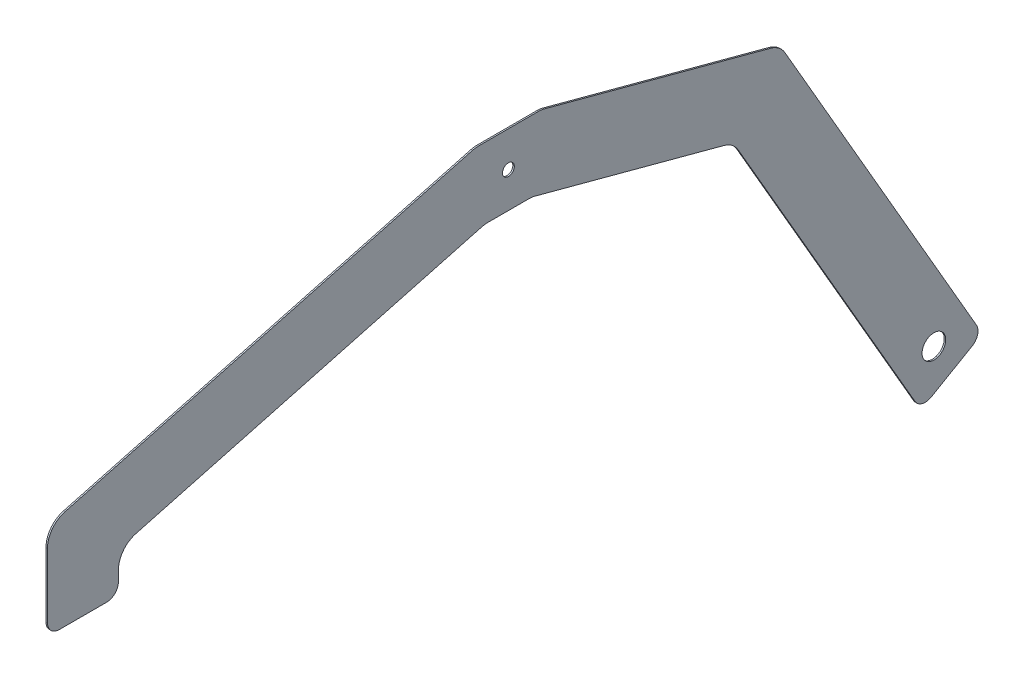
ISO-10303-21;
HEADER;
FILE_DESCRIPTION(('STEP AP214'),'2;1');
FILE_NAME('part.step','',(''),(''),'','','');
FILE_SCHEMA(('AUTOMOTIVE_DESIGN { 1 0 10303 214 1 1 1 1 }'));
ENDSEC;
DATA;
#1=APPLICATION_CONTEXT('core data for automotive mechanical design processes');
#2=APPLICATION_PROTOCOL_DEFINITION('international standard','automotive_design',2000,#1);
#3=PRODUCT_CONTEXT('',#1,'mechanical');
#4=PRODUCT('Part','Part','',(#3));
#5=PRODUCT_RELATED_PRODUCT_CATEGORY('part','',(#4));
#6=PRODUCT_DEFINITION_FORMATION('','',#4);
#7=PRODUCT_DEFINITION_CONTEXT('part definition',#1,'design');
#8=PRODUCT_DEFINITION('design','',#6,#7);
#9=PRODUCT_DEFINITION_SHAPE('','',#8);
#10=(LENGTH_UNIT() NAMED_UNIT(*) SI_UNIT(.MILLI.,.METRE.));
#11=(NAMED_UNIT(*) PLANE_ANGLE_UNIT() SI_UNIT($,.RADIAN.));
#12=(NAMED_UNIT(*) SI_UNIT($,.STERADIAN.) SOLID_ANGLE_UNIT());
#13=UNCERTAINTY_MEASURE_WITH_UNIT(LENGTH_MEASURE(1.E-05),#10,'distance_accuracy_value','');
#14=(GEOMETRIC_REPRESENTATION_CONTEXT(3) GLOBAL_UNCERTAINTY_ASSIGNED_CONTEXT((#13)) GLOBAL_UNIT_ASSIGNED_CONTEXT((#10,
#11,#12)) REPRESENTATION_CONTEXT('',''));
#15=CARTESIAN_POINT('',(0.,0.,0.));
#16=DIRECTION('',(0.,0.,1.));
#17=DIRECTION('',(1.,0.,0.));
#18=AXIS2_PLACEMENT_3D('',#15,#16,#17);
#19=CARTESIAN_POINT('',(1.5875,0.,0.));
#20=DIRECTION('',(-1.,0.,0.));
#21=DIRECTION('',(0.,0.,1.));
#22=AXIS2_PLACEMENT_3D('',#19,#20,#21);
#23=PLANE('',#22);
#24=DIRECTION('',(0.,0.499999999999998,-0.866025403784439));
#25=VECTOR('',#24,1.);
#26=CARTESIAN_POINT('',(1.5875,-445.14184846032,-443.254432115813));
#27=LINE('',#26,#25);
#28=CARTESIAN_POINT('',(1.5875,-438.79184846032,-454.252954743875));
#29=VERTEX_POINT('',#28);
#30=CARTESIAN_POINT('',(1.5875,-413.39184846032,-498.247045256125));
#31=VERTEX_POINT('',#30);
#32=EDGE_CURVE('E399',#29,#31,#27,.T.);
#33=ORIENTED_EDGE('',*,*,#32,.T.);
#34=CARTESIAN_POINT('',(1.5875,-402.393325832258,-491.897045256125));
#35=DIRECTION('',(-1.,0.,0.));
#36=DIRECTION('',(0.,0.,1.));
#37=AXIS2_PLACEMENT_3D('',#34,#35,#36);
#38=CIRCLE('',#37,12.7);
#39=CARTESIAN_POINT('',(1.5875,-396.043325832258,-502.895567884187));
#40=VERTEX_POINT('',#39);
#41=EDGE_CURVE('E323',#31,#40,#38,.F.);
#42=ORIENTED_EDGE('',*,*,#41,.T.);
#43=DIRECTION('',(0.,0.86602540378444,0.499999999999998));
#44=VECTOR('',#43,1.);
#45=CARTESIAN_POINT('',(1.5875,-407.04184846032,-509.245567884187));
#46=LINE('',#45,#44);
#47=CARTESIAN_POINT('',(1.5875,-39.7377700143835,-297.18245931898));
#48=VERTEX_POINT('',#47);
#49=EDGE_CURVE('E397',#40,#48,#46,.T.);
#50=ORIENTED_EDGE('',*,*,#49,.T.);
#51=CARTESIAN_POINT('',(1.5875,-52.4377700143834,-275.185414062855));
#52=DIRECTION('',(-1.,0.,0.));
#53=DIRECTION('',(0.,0.,1.));
#54=AXIS2_PLACEMENT_3D('',#51,#52,#53);
#55=CIRCLE('',#54,25.4);
#56=CARTESIAN_POINT('',(1.5875,-27.9032540266411,-281.759417808459));
#57=VERTEX_POINT('',#56);
#58=EDGE_CURVE('E289',#48,#57,#55,.F.);
#59=ORIENTED_EDGE('',*,*,#58,.T.);
#60=DIRECTION('',(0.,0.258819045102521,0.965925826289068));
#61=VECTOR('',#60,1.);
#62=CARTESIAN_POINT('',(1.5875,38.1,-35.4319203161596));
#63=LINE('',#62,#61);
#64=CARTESIAN_POINT('',(1.5875,37.2345159877423,-38.6619506230438));
#65=VERTEX_POINT('',#64);
#66=EDGE_CURVE('E392',#57,#65,#63,.T.);
#67=ORIENTED_EDGE('',*,*,#66,.T.);
#68=CARTESIAN_POINT('',(1.5875,12.7,-32.0879468774398));
#69=DIRECTION('',(-1.,0.,0.));
#70=DIRECTION('',(0.,0.,1.));
#71=AXIS2_PLACEMENT_3D('',#68,#69,#70);
#72=CIRCLE('',#71,25.4);
#73=CARTESIAN_POINT('',(1.5875,38.1,-32.0879468774398));
#74=VERTEX_POINT('',#73);
#75=EDGE_CURVE('E291',#65,#74,#72,.F.);
#76=ORIENTED_EDGE('',*,*,#75,.T.);
#77=DIRECTION('',(0.,0.,1.));
#78=VECTOR('',#77,1.);
#79=CARTESIAN_POINT('',(1.5875,38.1,35.4319203161593));
#80=LINE('',#79,#78);
#81=CARTESIAN_POINT('',(1.5875,38.1,32.0879468774396));
#82=VERTEX_POINT('',#81);
#83=EDGE_CURVE('E388',#74,#82,#80,.T.);
#84=ORIENTED_EDGE('',*,*,#83,.T.);
#85=CARTESIAN_POINT('',(1.5875,12.7,32.0879468774396));
#86=DIRECTION('',(-1.,0.,0.));
#87=DIRECTION('',(0.,0.,1.));
#88=AXIS2_PLACEMENT_3D('',#85,#86,#87);
#89=CIRCLE('',#88,25.4);
#90=CARTESIAN_POINT('',(1.5875,37.2345159877424,38.6619506230434));
#91=VERTEX_POINT('',#90);
#92=EDGE_CURVE('E293',#82,#91,#89,.F.);
#93=ORIENTED_EDGE('',*,*,#92,.T.);
#94=DIRECTION('',(0.,-0.258819045102514,0.96592582628907));
#95=VECTOR('',#94,1.);
#96=CARTESIAN_POINT('',(1.5875,38.1,35.4319203161593));
#97=LINE('',#96,#95);
#98=CARTESIAN_POINT('',(1.5875,-80.0768700830564,476.474003745604));
#99=VERTEX_POINT('',#98);
#100=EDGE_CURVE('E387',#91,#99,#97,.T.);
#101=ORIENTED_EDGE('',*,*,#100,.T.);
#102=CARTESIAN_POINT('',(1.5875,-104.611386070799,469.9));
#103=DIRECTION('',(-1.,0.,0.));
#104=DIRECTION('',(0.,0.,1.));
#105=AXIS2_PLACEMENT_3D('',#102,#103,#104);
#106=CIRCLE('',#105,25.4);
#107=CARTESIAN_POINT('',(1.5875,-104.611386070799,495.3));
#108=VERTEX_POINT('',#107);
#109=EDGE_CURVE('E234',#99,#108,#106,.F.);
#110=ORIENTED_EDGE('',*,*,#109,.T.);
#111=DIRECTION('',(0.,-1.,0.));
#112=VECTOR('',#111,1.);
#113=CARTESIAN_POINT('',(1.5875,-85.1212805761331,495.3));
#114=LINE('',#113,#112);
#115=CARTESIAN_POINT('',(1.5875,-174.021280576133,495.3));
#116=VERTEX_POINT('',#115);
#117=EDGE_CURVE('E215',#108,#116,#114,.T.);
#118=ORIENTED_EDGE('',*,*,#117,.T.);
#119=CARTESIAN_POINT('',(1.5875,-174.021280576133,482.6));
#120=DIRECTION('',(-1.,0.,0.));
#121=DIRECTION('',(0.,0.,1.));
#122=AXIS2_PLACEMENT_3D('',#119,#120,#121);
#123=CIRCLE('',#122,12.7);
#124=CARTESIAN_POINT('',(1.5875,-186.721280576133,482.6));
#125=VERTEX_POINT('',#124);
#126=EDGE_CURVE('E318',#116,#125,#123,.F.);
#127=ORIENTED_EDGE('',*,*,#126,.T.);
#128=DIRECTION('',(0.,0.,-1.));
#129=VECTOR('',#128,1.);
#130=CARTESIAN_POINT('',(1.5875,-186.721280576133,495.3));
#131=LINE('',#130,#129);
#132=CARTESIAN_POINT('',(1.5875,-186.721280576133,431.8));
#133=VERTEX_POINT('',#132);
#134=EDGE_CURVE('E216',#125,#133,#131,.T.);
#135=ORIENTED_EDGE('',*,*,#134,.T.);
#136=CARTESIAN_POINT('',(1.5875,-174.021280576133,431.8));
#137=DIRECTION('',(-1.,0.,0.));
#138=DIRECTION('',(0.,0.,1.));
#139=AXIS2_PLACEMENT_3D('',#136,#137,#138);
#140=CIRCLE('',#139,12.7);
#141=CARTESIAN_POINT('',(1.5875,-174.021280576133,419.1));
#142=VERTEX_POINT('',#141);
#143=EDGE_CURVE('E56',#133,#142,#140,.F.);
#144=ORIENTED_EDGE('',*,*,#143,.T.);
#145=DIRECTION('',(0.,1.,0.));
#146=VECTOR('',#145,1.);
#147=CARTESIAN_POINT('',(1.5875,-186.721280576133,419.1));
#148=LINE('',#147,#146);
#149=CARTESIAN_POINT('',(1.5875,-163.081702554796,419.1));
#150=VERTEX_POINT('',#149);
#151=EDGE_CURVE('E227',#142,#150,#148,.T.);
#152=ORIENTED_EDGE('',*,*,#151,.T.);
#153=CARTESIAN_POINT('',(1.5875,-163.081702554796,393.7));
#154=DIRECTION('',(-1.,0.,0.));
#155=DIRECTION('',(0.,0.,1.));
#156=AXIS2_PLACEMENT_3D('',#153,#154,#155);
#157=CIRCLE('',#156,25.4);
#158=CARTESIAN_POINT('',(1.5875,-138.547186567054,400.274003745604));
#159=VERTEX_POINT('',#158);
#160=EDGE_CURVE('E245',#150,#159,#157,.T.);
#161=ORIENTED_EDGE('',*,*,#160,.T.);
#162=DIRECTION('',(0.,0.258819045102515,-0.96592582628907));
#163=VECTOR('',#162,1.);
#164=CARTESIAN_POINT('',(1.5875,-38.1,25.4));
#165=LINE('',#164,#163);
#166=CARTESIAN_POINT('',(1.5875,-38.9654840122576,28.6300303068841));
#167=VERTEX_POINT('',#166);
#168=EDGE_CURVE('E409',#159,#167,#165,.T.);
#169=ORIENTED_EDGE('',*,*,#168,.T.);
#170=CARTESIAN_POINT('',(1.5875,-63.5,22.0560265612802));
#171=DIRECTION('',(-1.,0.,0.));
#172=DIRECTION('',(0.,0.,1.));
#173=AXIS2_PLACEMENT_3D('',#170,#171,#172);
#174=CIRCLE('',#173,25.4);
#175=CARTESIAN_POINT('',(1.5875,-38.1,22.0560265612802));
#176=VERTEX_POINT('',#175);
#177=EDGE_CURVE('E272',#167,#176,#174,.T.);
#178=ORIENTED_EDGE('',*,*,#177,.T.);
#179=DIRECTION('',(0.,0.,-1.));
#180=VECTOR('',#179,1.);
#181=CARTESIAN_POINT('',(1.5875,-38.1,25.4));
#182=LINE('',#181,#180);
#183=CARTESIAN_POINT('',(1.5875,-38.1,-22.0560265612801));
#184=VERTEX_POINT('',#183);
#185=EDGE_CURVE('E406',#176,#184,#182,.T.);
#186=ORIENTED_EDGE('',*,*,#185,.T.);
#187=CARTESIAN_POINT('',(1.5875,-63.5,-22.0560265612801));
#188=DIRECTION('',(-1.,0.,0.));
#189=DIRECTION('',(0.,0.,1.));
#190=AXIS2_PLACEMENT_3D('',#187,#188,#189);
#191=CIRCLE('',#190,25.4);
#192=CARTESIAN_POINT('',(1.5875,-38.9654840122577,-28.6300303068842));
#193=VERTEX_POINT('',#192);
#194=EDGE_CURVE('E268',#184,#193,#191,.T.);
#195=ORIENTED_EDGE('',*,*,#194,.T.);
#196=DIRECTION('',(0.,-0.258819045102521,-0.965925826289068));
#197=VECTOR('',#196,1.);
#198=CARTESIAN_POINT('',(1.5875,-38.1,-25.4));
#199=LINE('',#198,#197);
#200=CARTESIAN_POINT('',(1.5875,-93.3376774583059,-231.549818766499));
#201=VERTEX_POINT('',#200);
#202=EDGE_CURVE('E403',#193,#201,#199,.T.);
#203=ORIENTED_EDGE('',*,*,#202,.T.);
#204=CARTESIAN_POINT('',(1.5875,-117.872193446048,-224.975815020895));
#205=DIRECTION('',(-1.,0.,0.));
#206=DIRECTION('',(0.,0.,1.));
#207=AXIS2_PLACEMENT_3D('',#204,#205,#206);
#208=CIRCLE('',#207,25.4);
#209=CARTESIAN_POINT('',(1.5875,-105.172193446048,-246.97286027702));
#210=VERTEX_POINT('',#209);
#211=EDGE_CURVE('E264',#201,#210,#208,.T.);
#212=ORIENTED_EDGE('',*,*,#211,.T.);
#213=DIRECTION('',(0.,-0.86602540378444,-0.499999999999998));
#214=VECTOR('',#213,1.);
#215=CARTESIAN_POINT('',(1.5875,-96.0607189688267,-241.712348034882));
#216=LINE('',#215,#214);
#217=CARTESIAN_POINT('',(1.5875,-434.143325832258,-436.904432115813));
#218=VERTEX_POINT('',#217);
#219=EDGE_CURVE('E401',#210,#218,#216,.T.);
#220=ORIENTED_EDGE('',*,*,#219,.T.);
#221=CARTESIAN_POINT('',(1.5875,-427.793325832258,-447.902954743875));
#222=DIRECTION('',(-1.,0.,0.));
#223=DIRECTION('',(0.,0.,1.));
#224=AXIS2_PLACEMENT_3D('',#221,#222,#223);
#225=CIRCLE('',#224,12.7);
#226=EDGE_CURVE('E321',#218,#29,#225,.F.);
#227=ORIENTED_EDGE('',*,*,#226,.T.);
#228=EDGE_LOOP('',(#33,#42,#50,#59,#67,#76,#84,#93,#101,#110,#118,#127,#135,#144,#152,#161,#169,
#178,#186,#195,#203,#212,#220,#227));
#229=FACE_BOUND('',#228,.T.);
#230=CARTESIAN_POINT('',(1.5875,0.,0.));
#231=DIRECTION('',(1.,0.,0.));
#232=DIRECTION('',(0.,0.,-1.));
#233=AXIS2_PLACEMENT_3D('',#230,#231,#232);
#234=CIRCLE('',#233,6.35);
#235=CARTESIAN_POINT('',(1.5875,0.,-6.35));
#236=VERTEX_POINT('',#235);
#237=EDGE_CURVE('E350',#236,#236,#234,.T.);
#238=ORIENTED_EDGE('',*,*,#237,.F.);
#239=EDGE_LOOP('',(#238));
#240=FACE_BOUND('',#239,.T.);
#241=CARTESIAN_POINT('',(1.5875,-393.096280576133,-457.2));
#242=DIRECTION('',(1.,0.,0.));
#243=DIRECTION('',(0.,0.,-1.));
#244=AXIS2_PLACEMENT_3D('',#241,#242,#243);
#245=CIRCLE('',#244,12.6999999999998);
#246=CARTESIAN_POINT('',(1.5875,-393.096280576133,-469.9));
#247=VERTEX_POINT('',#246);
#248=EDGE_CURVE('E414',#247,#247,#245,.T.);
#249=ORIENTED_EDGE('',*,*,#248,.F.);
#250=EDGE_LOOP('',(#249));
#251=FACE_BOUND('',#250,.T.);
#252=ADVANCED_FACE('F33',(#229,#240,#251),#23,.F.);
#253=CARTESIAN_POINT('',(0.,0.,0.));
#254=DIRECTION('',(-1.,0.,0.));
#255=DIRECTION('',(0.,0.,1.));
#256=AXIS2_PLACEMENT_3D('',#253,#254,#255);
#257=PLANE('',#256);
#258=CARTESIAN_POINT('',(0.,0.,0.));
#259=DIRECTION('',(1.,0.,0.));
#260=DIRECTION('',(0.,0.,-1.));
#261=AXIS2_PLACEMENT_3D('',#258,#259,#260);
#262=CIRCLE('',#261,6.35);
#263=CARTESIAN_POINT('',(0.,0.,-6.35));
#264=VERTEX_POINT('',#263);
#265=EDGE_CURVE('E356',#264,#264,#262,.T.);
#266=ORIENTED_EDGE('',*,*,#265,.T.);
#267=EDGE_LOOP('',(#266));
#268=FACE_BOUND('',#267,.T.);
#269=DIRECTION('',(0.,0.86602540378444,0.499999999999998));
#270=VECTOR('',#269,1.);
#271=CARTESIAN_POINT('',(0.,-407.04184846032,-509.245567884187));
#272=LINE('',#271,#270);
#273=CARTESIAN_POINT('',(0.,-396.043325832258,-502.895567884187));
#274=VERTEX_POINT('',#273);
#275=CARTESIAN_POINT('',(0.,-39.7377700143835,-297.18245931898));
#276=VERTEX_POINT('',#275);
#277=EDGE_CURVE('E370',#274,#276,#272,.T.);
#278=ORIENTED_EDGE('',*,*,#277,.F.);
#279=CARTESIAN_POINT('',(0.,-402.393325832258,-491.897045256125));
#280=DIRECTION('',(-1.,0.,0.));
#281=DIRECTION('',(0.,0.,1.));
#282=AXIS2_PLACEMENT_3D('',#279,#280,#281);
#283=CIRCLE('',#282,12.7);
#284=CARTESIAN_POINT('',(0.,-413.39184846032,-498.247045256125));
#285=VERTEX_POINT('',#284);
#286=EDGE_CURVE('E311',#274,#285,#283,.T.);
#287=ORIENTED_EDGE('',*,*,#286,.T.);
#288=DIRECTION('',(0.,0.499999999999998,-0.866025403784439));
#289=VECTOR('',#288,1.);
#290=CARTESIAN_POINT('',(0.,-445.14184846032,-443.254432115813));
#291=LINE('',#290,#289);
#292=CARTESIAN_POINT('',(0.,-438.79184846032,-454.252954743875));
#293=VERTEX_POINT('',#292);
#294=EDGE_CURVE('E367',#293,#285,#291,.T.);
#295=ORIENTED_EDGE('',*,*,#294,.F.);
#296=CARTESIAN_POINT('',(0.,-427.793325832258,-447.902954743875));
#297=DIRECTION('',(-1.,0.,0.));
#298=DIRECTION('',(0.,0.,1.));
#299=AXIS2_PLACEMENT_3D('',#296,#297,#298);
#300=CIRCLE('',#299,12.7);
#301=CARTESIAN_POINT('',(0.,-434.143325832258,-436.904432115813));
#302=VERTEX_POINT('',#301);
#303=EDGE_CURVE('E309',#293,#302,#300,.T.);
#304=ORIENTED_EDGE('',*,*,#303,.T.);
#305=DIRECTION('',(0.,-0.86602540378444,-0.499999999999998));
#306=VECTOR('',#305,1.);
#307=CARTESIAN_POINT('',(0.,-96.0607189688267,-241.712348034882));
#308=LINE('',#307,#306);
#309=CARTESIAN_POINT('',(0.,-105.172193446048,-246.97286027702));
#310=VERTEX_POINT('',#309);
#311=EDGE_CURVE('E365',#310,#302,#308,.T.);
#312=ORIENTED_EDGE('',*,*,#311,.F.);
#313=CARTESIAN_POINT('',(0.,-117.872193446048,-224.975815020895));
#314=DIRECTION('',(-1.,0.,0.));
#315=DIRECTION('',(0.,0.,1.));
#316=AXIS2_PLACEMENT_3D('',#313,#314,#315);
#317=CIRCLE('',#316,25.4);
#318=CARTESIAN_POINT('',(0.,-93.3376774583059,-231.549818766499));
#319=VERTEX_POINT('',#318);
#320=EDGE_CURVE('E262',#310,#319,#317,.F.);
#321=ORIENTED_EDGE('',*,*,#320,.T.);
#322=DIRECTION('',(0.,-0.258819045102521,-0.965925826289068));
#323=VECTOR('',#322,1.);
#324=CARTESIAN_POINT('',(0.,-38.1,-25.4));
#325=LINE('',#324,#323);
#326=CARTESIAN_POINT('',(0.,-38.9654840122577,-28.6300303068842));
#327=VERTEX_POINT('',#326);
#328=EDGE_CURVE('E362',#327,#319,#325,.T.);
#329=ORIENTED_EDGE('',*,*,#328,.F.);
#330=CARTESIAN_POINT('',(0.,-63.5,-22.0560265612801));
#331=DIRECTION('',(-1.,0.,0.));
#332=DIRECTION('',(0.,0.,1.));
#333=AXIS2_PLACEMENT_3D('',#330,#331,#332);
#334=CIRCLE('',#333,25.4);
#335=CARTESIAN_POINT('',(0.,-38.1,-22.0560265612801));
#336=VERTEX_POINT('',#335);
#337=EDGE_CURVE('E266',#327,#336,#334,.F.);
#338=ORIENTED_EDGE('',*,*,#337,.T.);
#339=DIRECTION('',(0.,0.,-1.));
#340=VECTOR('',#339,1.);
#341=CARTESIAN_POINT('',(0.,-38.1,25.4));
#342=LINE('',#341,#340);
#343=CARTESIAN_POINT('',(0.,-38.1,22.0560265612802));
#344=VERTEX_POINT('',#343);
#345=EDGE_CURVE('E353',#344,#336,#342,.T.);
#346=ORIENTED_EDGE('',*,*,#345,.F.);
#347=CARTESIAN_POINT('',(0.,-63.5,22.0560265612802));
#348=DIRECTION('',(-1.,0.,0.));
#349=DIRECTION('',(0.,0.,1.));
#350=AXIS2_PLACEMENT_3D('',#347,#348,#349);
#351=CIRCLE('',#350,25.4);
#352=CARTESIAN_POINT('',(0.,-38.9654840122576,28.6300303068841));
#353=VERTEX_POINT('',#352);
#354=EDGE_CURVE('E270',#344,#353,#351,.F.);
#355=ORIENTED_EDGE('',*,*,#354,.T.);
#356=DIRECTION('',(0.,0.258819045102515,-0.96592582628907));
#357=VECTOR('',#356,1.);
#358=CARTESIAN_POINT('',(0.,-38.1,25.4));
#359=LINE('',#358,#357);
#360=CARTESIAN_POINT('',(0.,-138.547186567054,400.274003745604));
#361=VERTEX_POINT('',#360);
#362=EDGE_CURVE('E349',#361,#353,#359,.T.);
#363=ORIENTED_EDGE('',*,*,#362,.F.);
#364=CARTESIAN_POINT('',(0.,-163.081702554796,393.7));
#365=DIRECTION('',(-1.,0.,0.));
#366=DIRECTION('',(0.,0.,1.));
#367=AXIS2_PLACEMENT_3D('',#364,#365,#366);
#368=CIRCLE('',#367,25.4);
#369=CARTESIAN_POINT('',(0.,-163.081702554796,419.1));
#370=VERTEX_POINT('',#369);
#371=EDGE_CURVE('E242',#361,#370,#368,.F.);
#372=ORIENTED_EDGE('',*,*,#371,.T.);
#373=DIRECTION('',(0.,1.,0.));
#374=VECTOR('',#373,1.);
#375=CARTESIAN_POINT('',(0.,-186.721280576133,419.1));
#376=LINE('',#375,#374);
#377=CARTESIAN_POINT('',(0.,-174.021280576133,419.1));
#378=VERTEX_POINT('',#377);
#379=EDGE_CURVE('E346',#378,#370,#376,.T.);
#380=ORIENTED_EDGE('',*,*,#379,.F.);
#381=CARTESIAN_POINT('',(0.,-174.021280576133,431.8));
#382=DIRECTION('',(-1.,0.,0.));
#383=DIRECTION('',(0.,0.,1.));
#384=AXIS2_PLACEMENT_3D('',#381,#382,#383);
#385=CIRCLE('',#384,12.7);
#386=CARTESIAN_POINT('',(0.,-186.721280576133,431.8));
#387=VERTEX_POINT('',#386);
#388=EDGE_CURVE('E307',#378,#387,#385,.T.);
#389=ORIENTED_EDGE('',*,*,#388,.T.);
#390=DIRECTION('',(0.,0.,-1.));
#391=VECTOR('',#390,1.);
#392=CARTESIAN_POINT('',(0.,-186.721280576133,495.3));
#393=LINE('',#392,#391);
#394=CARTESIAN_POINT('',(0.,-186.721280576133,482.6));
#395=VERTEX_POINT('',#394);
#396=EDGE_CURVE('E223',#395,#387,#393,.T.);
#397=ORIENTED_EDGE('',*,*,#396,.F.);
#398=CARTESIAN_POINT('',(0.,-174.021280576133,482.6));
#399=DIRECTION('',(-1.,0.,0.));
#400=DIRECTION('',(0.,0.,1.));
#401=AXIS2_PLACEMENT_3D('',#398,#399,#400);
#402=CIRCLE('',#401,12.7);
#403=CARTESIAN_POINT('',(0.,-174.021280576133,495.3));
#404=VERTEX_POINT('',#403);
#405=EDGE_CURVE('E222',#395,#404,#402,.T.);
#406=ORIENTED_EDGE('',*,*,#405,.T.);
#407=DIRECTION('',(0.,-1.,0.));
#408=VECTOR('',#407,1.);
#409=CARTESIAN_POINT('',(0.,-85.1212805761331,495.3));
#410=LINE('',#409,#408);
#411=CARTESIAN_POINT('',(0.,-104.611386070799,495.3));
#412=VERTEX_POINT('',#411);
#413=EDGE_CURVE('E212',#412,#404,#410,.T.);
#414=ORIENTED_EDGE('',*,*,#413,.F.);
#415=CARTESIAN_POINT('',(0.,-104.611386070799,469.9));
#416=DIRECTION('',(-1.,0.,0.));
#417=DIRECTION('',(0.,0.,1.));
#418=AXIS2_PLACEMENT_3D('',#415,#416,#417);
#419=CIRCLE('',#418,25.4);
#420=CARTESIAN_POINT('',(0.,-80.0768700830564,476.474003745604));
#421=VERTEX_POINT('',#420);
#422=EDGE_CURVE('E197',#412,#421,#419,.T.);
#423=ORIENTED_EDGE('',*,*,#422,.T.);
#424=DIRECTION('',(0.,-0.258819045102514,0.96592582628907));
#425=VECTOR('',#424,1.);
#426=CARTESIAN_POINT('',(0.,38.1,35.4319203161593));
#427=LINE('',#426,#425);
#428=CARTESIAN_POINT('',(0.,37.2345159877424,38.6619506230434));
#429=VERTEX_POINT('',#428);
#430=EDGE_CURVE('E224',#429,#421,#427,.T.);
#431=ORIENTED_EDGE('',*,*,#430,.F.);
#432=CARTESIAN_POINT('',(0.,12.7,32.0879468774396));
#433=DIRECTION('',(-1.,0.,0.));
#434=DIRECTION('',(0.,0.,1.));
#435=AXIS2_PLACEMENT_3D('',#432,#433,#434);
#436=CIRCLE('',#435,25.4);
#437=CARTESIAN_POINT('',(0.,38.1,32.0879468774396));
#438=VERTEX_POINT('',#437);
#439=EDGE_CURVE('E282',#429,#438,#436,.T.);
#440=ORIENTED_EDGE('',*,*,#439,.T.);
#441=DIRECTION('',(0.,0.,1.));
#442=VECTOR('',#441,1.);
#443=CARTESIAN_POINT('',(0.,38.1,35.4319203161593));
#444=LINE('',#443,#442);
#445=CARTESIAN_POINT('',(0.,38.1,-32.0879468774398));
#446=VERTEX_POINT('',#445);
#447=EDGE_CURVE('E229',#446,#438,#444,.T.);
#448=ORIENTED_EDGE('',*,*,#447,.F.);
#449=CARTESIAN_POINT('',(0.,12.7,-32.0879468774398));
#450=DIRECTION('',(-1.,0.,0.));
#451=DIRECTION('',(0.,0.,1.));
#452=AXIS2_PLACEMENT_3D('',#449,#450,#451);
#453=CIRCLE('',#452,25.4);
#454=CARTESIAN_POINT('',(0.,37.2345159877423,-38.6619506230438));
#455=VERTEX_POINT('',#454);
#456=EDGE_CURVE('E280',#446,#455,#453,.T.);
#457=ORIENTED_EDGE('',*,*,#456,.T.);
#458=DIRECTION('',(0.,0.258819045102521,0.965925826289068));
#459=VECTOR('',#458,1.);
#460=CARTESIAN_POINT('',(0.,38.1,-35.4319203161596));
#461=LINE('',#460,#459);
#462=CARTESIAN_POINT('',(0.,-27.9032540266411,-281.759417808459));
#463=VERTEX_POINT('',#462);
#464=EDGE_CURVE('E372',#463,#455,#461,.T.);
#465=ORIENTED_EDGE('',*,*,#464,.F.);
#466=CARTESIAN_POINT('',(0.,-52.4377700143834,-275.185414062855));
#467=DIRECTION('',(-1.,0.,0.));
#468=DIRECTION('',(0.,0.,1.));
#469=AXIS2_PLACEMENT_3D('',#466,#467,#468);
#470=CIRCLE('',#469,25.4);
#471=EDGE_CURVE('E277',#463,#276,#470,.T.);
#472=ORIENTED_EDGE('',*,*,#471,.T.);
#473=EDGE_LOOP('',(#278,#287,#295,#304,#312,#321,#329,#338,#346,#355,#363,#372,#380,#389,#397,
#406,#414,#423,#431,#440,#448,#457,#465,#472));
#474=FACE_BOUND('',#473,.T.);
#475=CARTESIAN_POINT('',(0.,-393.096280576133,-457.2));
#476=DIRECTION('',(1.,0.,0.));
#477=DIRECTION('',(0.,0.,-1.));
#478=AXIS2_PLACEMENT_3D('',#475,#476,#477);
#479=CIRCLE('',#478,12.6999999999998);
#480=CARTESIAN_POINT('',(0.,-393.096280576133,-469.9));
#481=VERTEX_POINT('',#480);
#482=EDGE_CURVE('E416',#481,#481,#479,.T.);
#483=ORIENTED_EDGE('',*,*,#482,.T.);
#484=EDGE_LOOP('',(#483));
#485=FACE_BOUND('',#484,.T.);
#486=ADVANCED_FACE('F219',(#268,#474,#485),#257,.T.);
#487=CARTESIAN_POINT('',(1.5875,-186.721280576133,419.1));
#488=DIRECTION('',(0.,0.,1.));
#489=DIRECTION('',(0.,-1.,0.));
#490=AXIS2_PLACEMENT_3D('',#487,#488,#489);
#491=PLANE('',#490);
#492=ORIENTED_EDGE('',*,*,#151,.F.);
#493=DIRECTION('',(-1.,0.,0.));
#494=VECTOR('',#493,1.);
#495=CARTESIAN_POINT('',(1.5875,-174.021280576133,419.1));
#496=LINE('',#495,#494);
#497=EDGE_CURVE('E326',#142,#378,#496,.T.);
#498=ORIENTED_EDGE('',*,*,#497,.T.);
#499=ORIENTED_EDGE('',*,*,#379,.T.);
#500=DIRECTION('',(-1.,0.,0.));
#501=VECTOR('',#500,1.);
#502=CARTESIAN_POINT('',(1.5875,-163.081702554796,419.1));
#503=LINE('',#502,#501);
#504=EDGE_CURVE('E239',#370,#150,#503,.F.);
#505=ORIENTED_EDGE('',*,*,#504,.T.);
#506=EDGE_LOOP('',(#492,#498,#499,#505));
#507=FACE_BOUND('',#506,.T.);
#508=ADVANCED_FACE('F345',(#507),#491,.F.);
#509=CARTESIAN_POINT('',(1.5875,-38.1,25.4));
#510=DIRECTION('',(0.,0.96592582628907,0.258819045102515));
#511=DIRECTION('',(0.,-0.258819045102515,0.96592582628907));
#512=AXIS2_PLACEMENT_3D('',#509,#510,#511);
#513=PLANE('',#512);
#514=ORIENTED_EDGE('',*,*,#362,.T.);
#515=DIRECTION('',(-1.,0.,0.));
#516=VECTOR('',#515,1.);
#517=CARTESIAN_POINT('',(1.5875,-38.9654840122576,28.6300303068841));
#518=LINE('',#517,#516);
#519=EDGE_CURVE('E260',#353,#167,#518,.F.);
#520=ORIENTED_EDGE('',*,*,#519,.T.);
#521=ORIENTED_EDGE('',*,*,#168,.F.);
#522=DIRECTION('',(-1.,0.,0.));
#523=VECTOR('',#522,1.);
#524=CARTESIAN_POINT('',(0.,-138.547186567054,400.274003745604));
#525=LINE('',#524,#523);
#526=EDGE_CURVE('E236',#159,#361,#525,.T.);
#527=ORIENTED_EDGE('',*,*,#526,.T.);
#528=EDGE_LOOP('',(#514,#520,#521,#527));
#529=FACE_BOUND('',#528,.T.);
#530=ADVANCED_FACE('F466',(#529),#513,.F.);
#531=CARTESIAN_POINT('',(1.5875,-38.1,25.4));
#532=DIRECTION('',(0.,1.,0.));
#533=DIRECTION('',(0.,0.,1.));
#534=AXIS2_PLACEMENT_3D('',#531,#532,#533);
#535=PLANE('',#534);
#536=ORIENTED_EDGE('',*,*,#345,.T.);
#537=DIRECTION('',(-1.,0.,0.));
#538=VECTOR('',#537,1.);
#539=CARTESIAN_POINT('',(1.5875,-38.1,-22.0560265612801));
#540=LINE('',#539,#538);
#541=EDGE_CURVE('E258',#336,#184,#540,.F.);
#542=ORIENTED_EDGE('',*,*,#541,.T.);
#543=ORIENTED_EDGE('',*,*,#185,.F.);
#544=DIRECTION('',(-1.,0.,0.));
#545=VECTOR('',#544,1.);
#546=CARTESIAN_POINT('',(0.,-38.1,22.0560265612802));
#547=LINE('',#546,#545);
#548=EDGE_CURVE('E255',#176,#344,#547,.T.);
#549=ORIENTED_EDGE('',*,*,#548,.T.);
#550=EDGE_LOOP('',(#536,#542,#543,#549));
#551=FACE_BOUND('',#550,.T.);
#552=ADVANCED_FACE('F462',(#551),#535,.F.);
#553=CARTESIAN_POINT('',(1.5875,-38.1,-25.4));
#554=DIRECTION('',(0.,0.965925826289068,-0.258819045102521));
#555=DIRECTION('',(0.,0.258819045102521,0.965925826289068));
#556=AXIS2_PLACEMENT_3D('',#553,#554,#555);
#557=PLANE('',#556);
#558=ORIENTED_EDGE('',*,*,#328,.T.);
#559=DIRECTION('',(-1.,0.,0.));
#560=VECTOR('',#559,1.);
#561=CARTESIAN_POINT('',(1.5875,-93.3376774583059,-231.549818766499));
#562=LINE('',#561,#560);
#563=EDGE_CURVE('E253',#319,#201,#562,.F.);
#564=ORIENTED_EDGE('',*,*,#563,.T.);
#565=ORIENTED_EDGE('',*,*,#202,.F.);
#566=DIRECTION('',(-1.,0.,0.));
#567=VECTOR('',#566,1.);
#568=CARTESIAN_POINT('',(0.,-38.9654840122577,-28.6300303068842));
#569=LINE('',#568,#567);
#570=EDGE_CURVE('E250',#193,#327,#569,.T.);
#571=ORIENTED_EDGE('',*,*,#570,.T.);
#572=EDGE_LOOP('',(#558,#564,#565,#571));
#573=FACE_BOUND('',#572,.T.);
#574=ADVANCED_FACE('F459',(#573),#557,.F.);
#575=CARTESIAN_POINT('',(1.5875,-96.0607189688267,-241.712348034882));
#576=DIRECTION('',(0.,0.499999999999998,-0.86602540378444));
#577=DIRECTION('',(0.,0.86602540378444,0.499999999999998));
#578=AXIS2_PLACEMENT_3D('',#575,#576,#577);
#579=PLANE('',#578);
#580=ORIENTED_EDGE('',*,*,#311,.T.);
#581=DIRECTION('',(-1.,0.,0.));
#582=VECTOR('',#581,1.);
#583=CARTESIAN_POINT('',(1.5875,-434.143325832258,-436.904432115813));
#584=LINE('',#583,#582);
#585=EDGE_CURVE('E48',#302,#218,#584,.F.);
#586=ORIENTED_EDGE('',*,*,#585,.T.);
#587=ORIENTED_EDGE('',*,*,#219,.F.);
#588=DIRECTION('',(-1.,0.,0.));
#589=VECTOR('',#588,1.);
#590=CARTESIAN_POINT('',(0.,-105.172193446048,-246.97286027702));
#591=LINE('',#590,#589);
#592=EDGE_CURVE('E247',#210,#310,#591,.T.);
#593=ORIENTED_EDGE('',*,*,#592,.T.);
#594=EDGE_LOOP('',(#580,#586,#587,#593));
#595=FACE_BOUND('',#594,.T.);
#596=ADVANCED_FACE('F455',(#595),#579,.F.);
#597=CARTESIAN_POINT('',(1.5875,-445.14184846032,-443.254432115813));
#598=DIRECTION('',(0.,0.866025403784439,0.499999999999998));
#599=DIRECTION('',(0.,-0.499999999999999,0.86602540378444));
#600=AXIS2_PLACEMENT_3D('',#597,#598,#599);
#601=PLANE('',#600);
#602=ORIENTED_EDGE('',*,*,#294,.T.);
#603=DIRECTION('',(-1.,0.,0.));
#604=VECTOR('',#603,1.);
#605=CARTESIAN_POINT('',(1.5875,-413.39184846032,-498.247045256125));
#606=LINE('',#605,#604);
#607=EDGE_CURVE('E316',#285,#31,#606,.F.);
#608=ORIENTED_EDGE('',*,*,#607,.T.);
#609=ORIENTED_EDGE('',*,*,#32,.F.);
#610=DIRECTION('',(-1.,0.,0.));
#611=VECTOR('',#610,1.);
#612=CARTESIAN_POINT('',(1.5875,-438.79184846032,-454.252954743875));
#613=LINE('',#612,#611);
#614=EDGE_CURVE('E313',#29,#293,#613,.T.);
#615=ORIENTED_EDGE('',*,*,#614,.T.);
#616=EDGE_LOOP('',(#602,#608,#609,#615));
#617=FACE_BOUND('',#616,.T.);
#618=ADVANCED_FACE('F451',(#617),#601,.F.);
#619=CARTESIAN_POINT('',(1.5875,-407.04184846032,-509.245567884187));
#620=DIRECTION('',(0.,-0.499999999999998,0.86602540378444));
#621=DIRECTION('',(0.,-0.86602540378444,-0.499999999999998));
#622=AXIS2_PLACEMENT_3D('',#619,#620,#621);
#623=PLANE('',#622);
#624=ORIENTED_EDGE('',*,*,#49,.F.);
#625=DIRECTION('',(-1.,0.,0.));
#626=VECTOR('',#625,1.);
#627=CARTESIAN_POINT('',(1.5875,-396.043325832258,-502.895567884187));
#628=LINE('',#627,#626);
#629=EDGE_CURVE('E303',#40,#274,#628,.T.);
#630=ORIENTED_EDGE('',*,*,#629,.T.);
#631=ORIENTED_EDGE('',*,*,#277,.T.);
#632=DIRECTION('',(-1.,0.,0.));
#633=VECTOR('',#632,1.);
#634=CARTESIAN_POINT('',(1.5875,-39.7377700143835,-297.18245931898));
#635=LINE('',#634,#633);
#636=EDGE_CURVE('E300',#276,#48,#635,.F.);
#637=ORIENTED_EDGE('',*,*,#636,.T.);
#638=EDGE_LOOP('',(#624,#630,#631,#637));
#639=FACE_BOUND('',#638,.T.);
#640=ADVANCED_FACE('F447',(#639),#623,.F.);
#641=CARTESIAN_POINT('',(1.5875,38.1,-35.4319203161596));
#642=DIRECTION('',(0.,-0.965925826289068,0.258819045102521));
#643=DIRECTION('',(0.,-0.258819045102521,-0.965925826289068));
#644=AXIS2_PLACEMENT_3D('',#641,#642,#643);
#645=PLANE('',#644);
#646=ORIENTED_EDGE('',*,*,#464,.T.);
#647=DIRECTION('',(-1.,0.,0.));
#648=VECTOR('',#647,1.);
#649=CARTESIAN_POINT('',(1.5875,37.2345159877423,-38.6619506230438));
#650=LINE('',#649,#648);
#651=EDGE_CURVE('E298',#455,#65,#650,.F.);
#652=ORIENTED_EDGE('',*,*,#651,.T.);
#653=ORIENTED_EDGE('',*,*,#66,.F.);
#654=DIRECTION('',(-1.,0.,0.));
#655=VECTOR('',#654,1.);
#656=CARTESIAN_POINT('',(1.5875,-27.9032540266411,-281.759417808459));
#657=LINE('',#656,#655);
#658=EDGE_CURVE('E295',#57,#463,#657,.T.);
#659=ORIENTED_EDGE('',*,*,#658,.T.);
#660=EDGE_LOOP('',(#646,#652,#653,#659));
#661=FACE_BOUND('',#660,.T.);
#662=ADVANCED_FACE('F444',(#661),#645,.F.);
#663=CARTESIAN_POINT('',(1.5875,38.1,35.4319203161593));
#664=DIRECTION('',(0.,-1.,0.));
#665=DIRECTION('',(0.,0.,-1.));
#666=AXIS2_PLACEMENT_3D('',#663,#664,#665);
#667=PLANE('',#666);
#668=ORIENTED_EDGE('',*,*,#447,.T.);
#669=DIRECTION('',(-1.,0.,0.));
#670=VECTOR('',#669,1.);
#671=CARTESIAN_POINT('',(1.5875,38.1,32.0879468774396));
#672=LINE('',#671,#670);
#673=EDGE_CURVE('E287',#438,#82,#672,.F.);
#674=ORIENTED_EDGE('',*,*,#673,.T.);
#675=ORIENTED_EDGE('',*,*,#83,.F.);
#676=DIRECTION('',(-1.,0.,0.));
#677=VECTOR('',#676,1.);
#678=CARTESIAN_POINT('',(1.5875,38.1,-32.0879468774398));
#679=LINE('',#678,#677);
#680=EDGE_CURVE('E284',#74,#446,#679,.T.);
#681=ORIENTED_EDGE('',*,*,#680,.T.);
#682=EDGE_LOOP('',(#668,#674,#675,#681));
#683=FACE_BOUND('',#682,.T.);
#684=ADVANCED_FACE('F378',(#683),#667,.F.);
#685=CARTESIAN_POINT('',(1.5875,38.1,35.4319203161593));
#686=DIRECTION('',(0.,-0.96592582628907,-0.258819045102514));
#687=DIRECTION('',(0.,0.258819045102515,-0.96592582628907));
#688=AXIS2_PLACEMENT_3D('',#685,#686,#687);
#689=PLANE('',#688);
#690=ORIENTED_EDGE('',*,*,#100,.F.);
#691=DIRECTION('',(-1.,0.,0.));
#692=VECTOR('',#691,1.);
#693=CARTESIAN_POINT('',(1.5875,37.2345159877424,38.6619506230434));
#694=LINE('',#693,#692);
#695=EDGE_CURVE('E274',#91,#429,#694,.T.);
#696=ORIENTED_EDGE('',*,*,#695,.T.);
#697=ORIENTED_EDGE('',*,*,#430,.T.);
#698=DIRECTION('',(-1.,0.,0.));
#699=VECTOR('',#698,1.);
#700=CARTESIAN_POINT('',(1.5875,-80.0768700830564,476.474003745604));
#701=LINE('',#700,#699);
#702=EDGE_CURVE('E203',#421,#99,#701,.F.);
#703=ORIENTED_EDGE('',*,*,#702,.T.);
#704=EDGE_LOOP('',(#690,#696,#697,#703));
#705=FACE_BOUND('',#704,.T.);
#706=ADVANCED_FACE('F390',(#705),#689,.F.);
#707=CARTESIAN_POINT('',(1.5875,-85.1212805761331,495.3));
#708=DIRECTION('',(0.,0.,-1.));
#709=DIRECTION('',(-1.,0.,0.));
#710=AXIS2_PLACEMENT_3D('',#707,#708,#709);
#711=PLANE('',#710);
#712=ORIENTED_EDGE('',*,*,#413,.T.);
#713=DIRECTION('',(-1.,0.,0.));
#714=VECTOR('',#713,1.);
#715=CARTESIAN_POINT('',(1.5875,-174.021280576133,495.3));
#716=LINE('',#715,#714);
#717=EDGE_CURVE('E11',#404,#116,#716,.F.);
#718=ORIENTED_EDGE('',*,*,#717,.T.);
#719=ORIENTED_EDGE('',*,*,#117,.F.);
#720=DIRECTION('',(-1.,0.,0.));
#721=VECTOR('',#720,1.);
#722=CARTESIAN_POINT('',(1.5875,-104.611386070799,495.3));
#723=LINE('',#722,#721);
#724=EDGE_CURVE('E201',#108,#412,#723,.T.);
#725=ORIENTED_EDGE('',*,*,#724,.T.);
#726=EDGE_LOOP('',(#712,#718,#719,#725));
#727=FACE_BOUND('',#726,.T.);
#728=ADVANCED_FACE('F211',(#727),#711,.F.);
#729=CARTESIAN_POINT('',(1.5875,-186.721280576133,495.3));
#730=DIRECTION('',(0.,1.,0.));
#731=DIRECTION('',(0.,0.,1.));
#732=AXIS2_PLACEMENT_3D('',#729,#730,#731);
#733=PLANE('',#732);
#734=ORIENTED_EDGE('',*,*,#396,.T.);
#735=DIRECTION('',(-1.,0.,0.));
#736=VECTOR('',#735,1.);
#737=CARTESIAN_POINT('',(1.5875,-186.721280576133,431.8));
#738=LINE('',#737,#736);
#739=EDGE_CURVE('E41',#387,#133,#738,.F.);
#740=ORIENTED_EDGE('',*,*,#739,.T.);
#741=ORIENTED_EDGE('',*,*,#134,.F.);
#742=DIRECTION('',(-1.,0.,0.));
#743=VECTOR('',#742,1.);
#744=CARTESIAN_POINT('',(1.5875,-186.721280576133,482.6));
#745=LINE('',#744,#743);
#746=EDGE_CURVE('E329',#125,#395,#745,.T.);
#747=ORIENTED_EDGE('',*,*,#746,.T.);
#748=EDGE_LOOP('',(#734,#740,#741,#747));
#749=FACE_BOUND('',#748,.T.);
#750=ADVANCED_FACE('F334',(#749),#733,.F.);
#751=CARTESIAN_POINT('',(1.5875,0.,0.));
#752=DIRECTION('',(-1.,0.,0.));
#753=DIRECTION('',(0.,0.,1.));
#754=AXIS2_PLACEMENT_3D('',#751,#752,#753);
#755=CYLINDRICAL_SURFACE('',#754,6.35);
#756=ORIENTED_EDGE('',*,*,#237,.T.);
#757=EDGE_LOOP('',(#756));
#758=FACE_BOUND('',#757,.T.);
#759=ORIENTED_EDGE('',*,*,#265,.F.);
#760=EDGE_LOOP('',(#759));
#761=FACE_BOUND('',#760,.T.);
#762=ADVANCED_FACE('F433',(#758,#761),#755,.F.);
#763=CARTESIAN_POINT('',(1.5875,-393.096280576133,-457.2));
#764=DIRECTION('',(-1.,0.,0.));
#765=DIRECTION('',(0.,0.,1.));
#766=AXIS2_PLACEMENT_3D('',#763,#764,#765);
#767=CYLINDRICAL_SURFACE('',#766,12.6999999999998);
#768=ORIENTED_EDGE('',*,*,#248,.T.);
#769=EDGE_LOOP('',(#768));
#770=FACE_BOUND('',#769,.T.);
#771=ORIENTED_EDGE('',*,*,#482,.F.);
#772=EDGE_LOOP('',(#771));
#773=FACE_BOUND('',#772,.T.);
#774=ADVANCED_FACE('F422',(#770,#773),#767,.F.);
#775=CARTESIAN_POINT('',(1.5875,-104.611386070799,469.9));
#776=DIRECTION('',(-1.,0.,0.));
#777=DIRECTION('',(0.,0.,1.));
#778=AXIS2_PLACEMENT_3D('',#775,#776,#777);
#779=CYLINDRICAL_SURFACE('',#778,25.4);
#780=ORIENTED_EDGE('',*,*,#109,.F.);
#781=ORIENTED_EDGE('',*,*,#702,.F.);
#782=ORIENTED_EDGE('',*,*,#422,.F.);
#783=ORIENTED_EDGE('',*,*,#724,.F.);
#784=EDGE_LOOP('',(#780,#781,#782,#783));
#785=FACE_BOUND('',#784,.T.);
#786=ADVANCED_FACE('F200',(#785),#779,.T.);
#787=CARTESIAN_POINT('',(1.5875,-163.081702554796,393.7));
#788=DIRECTION('',(1.,0.,0.));
#789=DIRECTION('',(0.,0.,-1.));
#790=AXIS2_PLACEMENT_3D('',#787,#788,#789);
#791=CYLINDRICAL_SURFACE('',#790,25.4);
#792=ORIENTED_EDGE('',*,*,#160,.F.);
#793=ORIENTED_EDGE('',*,*,#504,.F.);
#794=ORIENTED_EDGE('',*,*,#371,.F.);
#795=ORIENTED_EDGE('',*,*,#526,.F.);
#796=EDGE_LOOP('',(#792,#793,#794,#795));
#797=FACE_BOUND('',#796,.T.);
#798=ADVANCED_FACE('F475',(#797),#791,.F.);
#799=CARTESIAN_POINT('',(1.5875,-117.872193446048,-224.975815020895));
#800=DIRECTION('',(1.,0.,0.));
#801=DIRECTION('',(0.,0.,-1.));
#802=AXIS2_PLACEMENT_3D('',#799,#800,#801);
#803=CYLINDRICAL_SURFACE('',#802,25.4);
#804=ORIENTED_EDGE('',*,*,#211,.F.);
#805=ORIENTED_EDGE('',*,*,#563,.F.);
#806=ORIENTED_EDGE('',*,*,#320,.F.);
#807=ORIENTED_EDGE('',*,*,#592,.F.);
#808=EDGE_LOOP('',(#804,#805,#806,#807));
#809=FACE_BOUND('',#808,.T.);
#810=ADVANCED_FACE('F478',(#809),#803,.F.);
#811=CARTESIAN_POINT('',(1.5875,-63.5,-22.0560265612801));
#812=DIRECTION('',(1.,0.,0.));
#813=DIRECTION('',(0.,0.,-1.));
#814=AXIS2_PLACEMENT_3D('',#811,#812,#813);
#815=CYLINDRICAL_SURFACE('',#814,25.4);
#816=ORIENTED_EDGE('',*,*,#194,.F.);
#817=ORIENTED_EDGE('',*,*,#541,.F.);
#818=ORIENTED_EDGE('',*,*,#337,.F.);
#819=ORIENTED_EDGE('',*,*,#570,.F.);
#820=EDGE_LOOP('',(#816,#817,#818,#819));
#821=FACE_BOUND('',#820,.T.);
#822=ADVANCED_FACE('F482',(#821),#815,.F.);
#823=CARTESIAN_POINT('',(1.5875,-63.5,22.0560265612802));
#824=DIRECTION('',(1.,0.,0.));
#825=DIRECTION('',(0.,0.,-1.));
#826=AXIS2_PLACEMENT_3D('',#823,#824,#825);
#827=CYLINDRICAL_SURFACE('',#826,25.4);
#828=ORIENTED_EDGE('',*,*,#177,.F.);
#829=ORIENTED_EDGE('',*,*,#519,.F.);
#830=ORIENTED_EDGE('',*,*,#354,.F.);
#831=ORIENTED_EDGE('',*,*,#548,.F.);
#832=EDGE_LOOP('',(#828,#829,#830,#831));
#833=FACE_BOUND('',#832,.T.);
#834=ADVANCED_FACE('F486',(#833),#827,.F.);
#835=CARTESIAN_POINT('',(1.5875,12.7,32.0879468774396));
#836=DIRECTION('',(-1.,0.,0.));
#837=DIRECTION('',(0.,0.,1.));
#838=AXIS2_PLACEMENT_3D('',#835,#836,#837);
#839=CYLINDRICAL_SURFACE('',#838,25.4);
#840=ORIENTED_EDGE('',*,*,#92,.F.);
#841=ORIENTED_EDGE('',*,*,#673,.F.);
#842=ORIENTED_EDGE('',*,*,#439,.F.);
#843=ORIENTED_EDGE('',*,*,#695,.F.);
#844=EDGE_LOOP('',(#840,#841,#842,#843));
#845=FACE_BOUND('',#844,.T.);
#846=ADVANCED_FACE('F384',(#845),#839,.T.);
#847=CARTESIAN_POINT('',(1.5875,12.7,-32.0879468774398));
#848=DIRECTION('',(-1.,0.,0.));
#849=DIRECTION('',(0.,0.,1.));
#850=AXIS2_PLACEMENT_3D('',#847,#848,#849);
#851=CYLINDRICAL_SURFACE('',#850,25.4);
#852=ORIENTED_EDGE('',*,*,#75,.F.);
#853=ORIENTED_EDGE('',*,*,#651,.F.);
#854=ORIENTED_EDGE('',*,*,#456,.F.);
#855=ORIENTED_EDGE('',*,*,#680,.F.);
#856=EDGE_LOOP('',(#852,#853,#854,#855));
#857=FACE_BOUND('',#856,.T.);
#858=ADVANCED_FACE('F493',(#857),#851,.T.);
#859=CARTESIAN_POINT('',(1.5875,-52.4377700143834,-275.185414062855));
#860=DIRECTION('',(-1.,0.,0.));
#861=DIRECTION('',(0.,0.,1.));
#862=AXIS2_PLACEMENT_3D('',#859,#860,#861);
#863=CYLINDRICAL_SURFACE('',#862,25.4);
#864=ORIENTED_EDGE('',*,*,#58,.F.);
#865=ORIENTED_EDGE('',*,*,#636,.F.);
#866=ORIENTED_EDGE('',*,*,#471,.F.);
#867=ORIENTED_EDGE('',*,*,#658,.F.);
#868=EDGE_LOOP('',(#864,#865,#866,#867));
#869=FACE_BOUND('',#868,.T.);
#870=ADVANCED_FACE('F496',(#869),#863,.T.);
#871=CARTESIAN_POINT('',(1.5875,-402.393325832258,-491.897045256125));
#872=DIRECTION('',(-1.,0.,0.));
#873=DIRECTION('',(0.,0.,1.));
#874=AXIS2_PLACEMENT_3D('',#871,#872,#873);
#875=CYLINDRICAL_SURFACE('',#874,12.7);
#876=ORIENTED_EDGE('',*,*,#41,.F.);
#877=ORIENTED_EDGE('',*,*,#607,.F.);
#878=ORIENTED_EDGE('',*,*,#286,.F.);
#879=ORIENTED_EDGE('',*,*,#629,.F.);
#880=EDGE_LOOP('',(#876,#877,#878,#879));
#881=FACE_BOUND('',#880,.T.);
#882=ADVANCED_FACE('F500',(#881),#875,.T.);
#883=CARTESIAN_POINT('',(1.5875,-427.793325832258,-447.902954743875));
#884=DIRECTION('',(-1.,0.,0.));
#885=DIRECTION('',(0.,0.,1.));
#886=AXIS2_PLACEMENT_3D('',#883,#884,#885);
#887=CYLINDRICAL_SURFACE('',#886,12.7);
#888=ORIENTED_EDGE('',*,*,#226,.F.);
#889=ORIENTED_EDGE('',*,*,#585,.F.);
#890=ORIENTED_EDGE('',*,*,#303,.F.);
#891=ORIENTED_EDGE('',*,*,#614,.F.);
#892=EDGE_LOOP('',(#888,#889,#890,#891));
#893=FACE_BOUND('',#892,.T.);
#894=ADVANCED_FACE('F504',(#893),#887,.T.);
#895=CARTESIAN_POINT('',(1.5875,-174.021280576133,431.8));
#896=DIRECTION('',(-1.,0.,0.));
#897=DIRECTION('',(0.,0.,1.));
#898=AXIS2_PLACEMENT_3D('',#895,#896,#897);
#899=CYLINDRICAL_SURFACE('',#898,12.7);
#900=ORIENTED_EDGE('',*,*,#143,.F.);
#901=ORIENTED_EDGE('',*,*,#739,.F.);
#902=ORIENTED_EDGE('',*,*,#388,.F.);
#903=ORIENTED_EDGE('',*,*,#497,.F.);
#904=EDGE_LOOP('',(#900,#901,#902,#903));
#905=FACE_BOUND('',#904,.T.);
#906=ADVANCED_FACE('F342',(#905),#899,.T.);
#907=CARTESIAN_POINT('',(1.5875,-174.021280576133,482.6));
#908=DIRECTION('',(-1.,0.,0.));
#909=DIRECTION('',(0.,0.,1.));
#910=AXIS2_PLACEMENT_3D('',#907,#908,#909);
#911=CYLINDRICAL_SURFACE('',#910,12.7);
#912=ORIENTED_EDGE('',*,*,#126,.F.);
#913=ORIENTED_EDGE('',*,*,#717,.F.);
#914=ORIENTED_EDGE('',*,*,#405,.F.);
#915=ORIENTED_EDGE('',*,*,#746,.F.);
#916=EDGE_LOOP('',(#912,#913,#914,#915));
#917=FACE_BOUND('',#916,.T.);
#918=ADVANCED_FACE('F35',(#917),#911,.T.);
#919=CLOSED_SHELL('',(#252,#486,#508,#530,#552,#574,#596,#618,#640,#662,#684,#706,#728,#750,
#762,#774,#786,#798,#810,#822,#834,#846,#858,#870,#882,#894,#906,#918));
#920=MANIFOLD_SOLID_BREP('B2',#919);
#921=ADVANCED_BREP_SHAPE_REPRESENTATION('',(#18,#920),#14);
#922=SHAPE_DEFINITION_REPRESENTATION(#9,#921);
ENDSEC;
END-ISO-10303-21;
